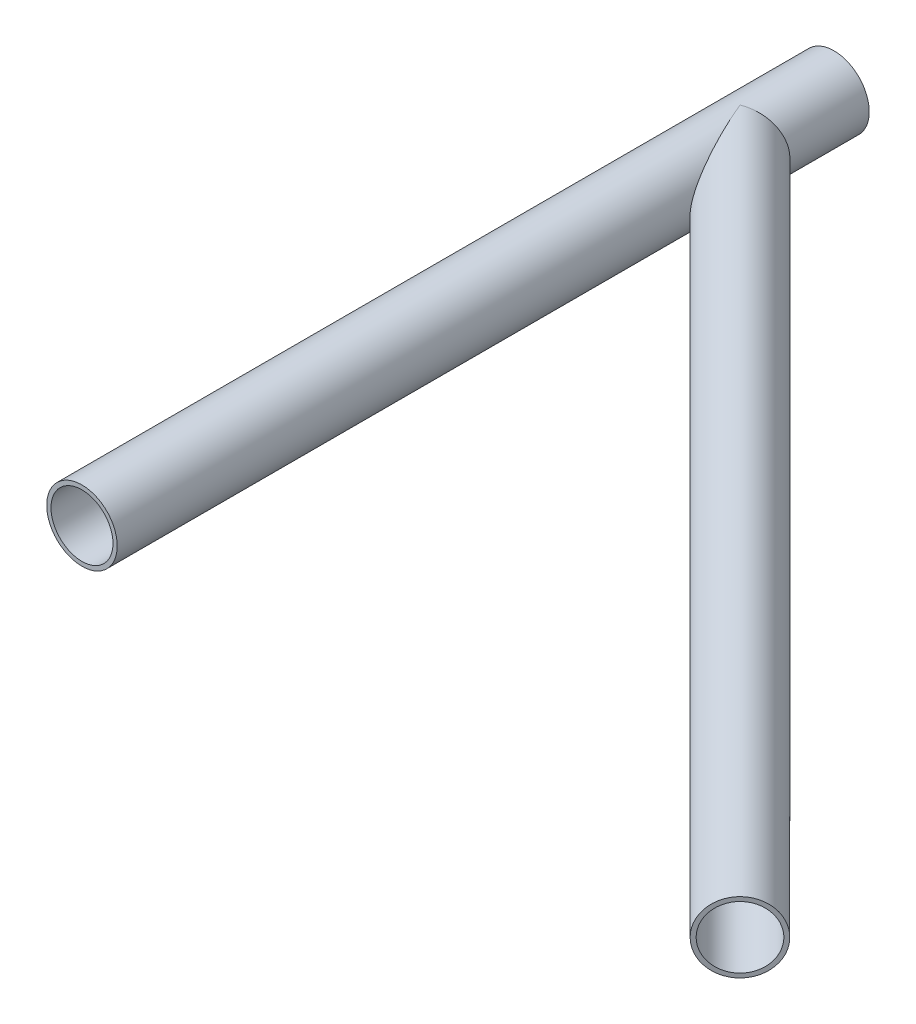
ISO-10303-21;
HEADER;
FILE_DESCRIPTION(('STEP AP214'),'2;1');
FILE_NAME('part.step','',(''),(''),'','','');
FILE_SCHEMA(('AUTOMOTIVE_DESIGN { 1 0 10303 214 1 1 1 1 }'));
ENDSEC;
DATA;
#1=APPLICATION_CONTEXT('core data for automotive mechanical design processes');
#2=APPLICATION_PROTOCOL_DEFINITION('international standard','automotive_design',2000,#1);
#3=PRODUCT_CONTEXT('',#1,'mechanical');
#4=PRODUCT('Part','Part','',(#3));
#5=PRODUCT_RELATED_PRODUCT_CATEGORY('part','',(#4));
#6=PRODUCT_DEFINITION_FORMATION('','',#4);
#7=PRODUCT_DEFINITION_CONTEXT('part definition',#1,'design');
#8=PRODUCT_DEFINITION('design','',#6,#7);
#9=PRODUCT_DEFINITION_SHAPE('','',#8);
#10=(LENGTH_UNIT() NAMED_UNIT(*) SI_UNIT(.MILLI.,.METRE.));
#11=(NAMED_UNIT(*) PLANE_ANGLE_UNIT() SI_UNIT($,.RADIAN.));
#12=(NAMED_UNIT(*) SI_UNIT($,.STERADIAN.) SOLID_ANGLE_UNIT());
#13=UNCERTAINTY_MEASURE_WITH_UNIT(LENGTH_MEASURE(1.E-05),#10,'distance_accuracy_value','');
#14=(GEOMETRIC_REPRESENTATION_CONTEXT(3) GLOBAL_UNCERTAINTY_ASSIGNED_CONTEXT((#13)) GLOBAL_UNIT_ASSIGNED_CONTEXT((#10,
#11,#12)) REPRESENTATION_CONTEXT('',''));
#15=CARTESIAN_POINT('',(0.,0.,0.));
#16=DIRECTION('',(0.,0.,1.));
#17=DIRECTION('',(1.,0.,0.));
#18=AXIS2_PLACEMENT_3D('',#15,#16,#17);
#19=CARTESIAN_POINT('',(0.,0.,203.2));
#20=DIRECTION('',(0.,0.,1.));
#21=DIRECTION('',(1.,0.,0.));
#22=AXIS2_PLACEMENT_3D('',#19,#20,#21);
#23=PLANE('',#22);
#24=CARTESIAN_POINT('',(0.,0.,203.2));
#25=DIRECTION('',(0.,0.,1.));
#26=DIRECTION('',(1.,0.,0.));
#27=AXIS2_PLACEMENT_3D('',#24,#25,#26);
#28=CIRCLE('',#27,9.525);
#29=CARTESIAN_POINT('',(9.525,0.,203.2));
#30=VERTEX_POINT('',#29);
#31=EDGE_CURVE('E177',#30,#30,#28,.T.);
#32=ORIENTED_EDGE('',*,*,#31,.T.);
#33=EDGE_LOOP('',(#32));
#34=FACE_BOUND('',#33,.T.);
#35=CARTESIAN_POINT('',(0.,0.,203.2));
#36=DIRECTION('',(0.,0.,1.));
#37=DIRECTION('',(1.,0.,0.));
#38=AXIS2_PLACEMENT_3D('',#35,#36,#37);
#39=CIRCLE('',#38,8.382);
#40=CARTESIAN_POINT('',(8.382,0.,203.2));
#41=VERTEX_POINT('',#40);
#42=EDGE_CURVE('E170',#41,#41,#39,.T.);
#43=ORIENTED_EDGE('',*,*,#42,.F.);
#44=EDGE_LOOP('',(#43));
#45=FACE_BOUND('',#44,.T.);
#46=ADVANCED_FACE('F48',(#34,#45),#23,.T.);
#47=CARTESIAN_POINT('',(0.,0.,0.));
#48=DIRECTION('',(0.,0.,1.));
#49=DIRECTION('',(1.,0.,0.));
#50=AXIS2_PLACEMENT_3D('',#47,#48,#49);
#51=PLANE('',#50);
#52=CARTESIAN_POINT('',(0.,0.,0.));
#53=DIRECTION('',(0.,0.,1.));
#54=DIRECTION('',(1.,0.,0.));
#55=AXIS2_PLACEMENT_3D('',#52,#53,#54);
#56=CIRCLE('',#55,9.525);
#57=CARTESIAN_POINT('',(9.525,0.,0.));
#58=VERTEX_POINT('',#57);
#59=EDGE_CURVE('E165',#58,#58,#56,.T.);
#60=ORIENTED_EDGE('',*,*,#59,.F.);
#61=EDGE_LOOP('',(#60));
#62=FACE_BOUND('',#61,.T.);
#63=CARTESIAN_POINT('',(0.,0.,0.));
#64=DIRECTION('',(0.,0.,1.));
#65=DIRECTION('',(1.,0.,0.));
#66=AXIS2_PLACEMENT_3D('',#63,#64,#65);
#67=CIRCLE('',#66,8.382);
#68=CARTESIAN_POINT('',(8.382,0.,0.));
#69=VERTEX_POINT('',#68);
#70=EDGE_CURVE('E168',#69,#69,#67,.T.);
#71=ORIENTED_EDGE('',*,*,#70,.T.);
#72=EDGE_LOOP('',(#71));
#73=FACE_BOUND('',#72,.T.);
#74=ADVANCED_FACE('F153',(#62,#73),#51,.F.);
#75=CARTESIAN_POINT('',(0.,0.,203.2));
#76=DIRECTION('',(0.,0.,-1.));
#77=DIRECTION('',(-1.,0.,0.));
#78=AXIS2_PLACEMENT_3D('',#75,#76,#77);
#79=CYLINDRICAL_SURFACE('',#78,9.525);
#80=CARTESIAN_POINT('',(0.,0.,25.4));
#81=DIRECTION('',(0.923879532511287,0.,-0.38268343236509));
#82=DIRECTION('',(-0.38268343236509,0.,-0.923879532511287));
#83=AXIS2_PLACEMENT_3D('',#80,#81,#82);
#84=ELLIPSE('',#83,24.890024480895,9.525);
#85=CARTESIAN_POINT('',(0.,-9.525,25.3999999999999));
#86=VERTEX_POINT('',#85);
#87=CARTESIAN_POINT('',(0.,9.525,25.4));
#88=VERTEX_POINT('',#87);
#89=EDGE_CURVE('E114',#86,#88,#84,.F.);
#90=ORIENTED_EDGE('',*,*,#89,.T.);
#91=CARTESIAN_POINT('',(0.,0.,25.4));
#92=DIRECTION('',(-0.38268343236509,0.,-0.923879532511287));
#93=DIRECTION('',(0.923879532511287,0.,-0.38268343236509));
#94=AXIS2_PLACEMENT_3D('',#91,#92,#93);
#95=ELLIPSE('',#94,10.3097857077851,9.525);
#96=EDGE_CURVE('E171',#88,#86,#95,.T.);
#97=ORIENTED_EDGE('',*,*,#96,.T.);
#98=EDGE_LOOP('',(#90,#97));
#99=FACE_BOUND('',#98,.T.);
#100=ORIENTED_EDGE('',*,*,#31,.F.);
#101=EDGE_LOOP('',(#100));
#102=FACE_BOUND('',#101,.T.);
#103=ORIENTED_EDGE('',*,*,#59,.T.);
#104=EDGE_LOOP('',(#103));
#105=FACE_BOUND('',#104,.T.);
#106=ADVANCED_FACE('F50',(#99,#102,#105),#79,.T.);
#107=CARTESIAN_POINT('',(0.,0.,203.2));
#108=DIRECTION('',(0.,0.,-1.));
#109=DIRECTION('',(-1.,0.,0.));
#110=AXIS2_PLACEMENT_3D('',#107,#108,#109);
#111=CYLINDRICAL_SURFACE('',#110,8.382);
#112=CARTESIAN_POINT('',(0.,0.,25.3999999999999));
#113=DIRECTION('',(-0.707106781186547,0.,-0.707106781186548));
#114=DIRECTION('',(0.707106781186548,0.,-0.707106781186547));
#115=AXIS2_PLACEMENT_3D('',#112,#113,#114);
#116=ELLIPSE('',#115,11.8539380798113,8.382);
#117=CARTESIAN_POINT('',(4.52412433516134,-7.05621874660933,20.8758756648385));
#118=VERTEX_POINT('',#117);
#119=CARTESIAN_POINT('',(0.,-8.382,25.4));
#120=VERTEX_POINT('',#119);
#121=EDGE_CURVE('E64',#118,#120,#116,.T.);
#122=ORIENTED_EDGE('',*,*,#121,.F.);
#123=CARTESIAN_POINT('',(4.52412433516129,7.05621874660936,20.8758756648385));
#124=CARTESIAN_POINT('',(4.62174690177862,6.99362881718293,20.8758673416063));
#125=CARTESIAN_POINT('',(4.71804626749071,6.92902582801489,20.8742967163056));
#126=CARTESIAN_POINT('',(4.90781368240917,6.79593377943272,20.8685236637419));
#127=CARTESIAN_POINT('',(5.00128228957891,6.72744549358692,20.8643217587099));
#128=CARTESIAN_POINT('',(5.27704085145179,6.5164628477521,20.8485173389705));
#129=CARTESIAN_POINT('',(5.45487649013221,6.36832690177239,20.8337141594394));
#130=CARTESIAN_POINT('',(5.79716785090296,6.05838602455667,20.7987657494469));
#131=CARTESIAN_POINT('',(5.96163929909287,5.89659762961534,20.7786269201619));
#132=CARTESIAN_POINT('',(6.27655652399811,5.56020205429996,20.7354317057933));
#133=CARTESIAN_POINT('',(6.42699950838211,5.38559233418328,20.712374742006));
#134=CARTESIAN_POINT('',(6.712618088321,5.02508226793645,20.6653123290561));
#135=CARTESIAN_POINT('',(6.84782756036084,4.8392084469075,20.641309151385));
#136=CARTESIAN_POINT('',(7.10254989276725,4.45695554239161,20.5938036813221));
#137=CARTESIAN_POINT('',(7.22206382909776,4.26057718031457,20.5703013546885));
#138=CARTESIAN_POINT('',(7.44463432618506,3.85851520872857,20.5249857303182));
#139=CARTESIAN_POINT('',(7.54769086481554,3.65283158670956,20.5031724348524));
#140=CARTESIAN_POINT('',(7.73663621475474,3.23346217153021,20.4621794158011));
#141=CARTESIAN_POINT('',(7.82252455932843,3.01977616100418,20.4429997638185));
#142=CARTESIAN_POINT('',(7.97855041747182,2.58002409887501,20.407550037183));
#143=CARTESIAN_POINT('',(8.04820737636085,2.35377989379141,20.3913710849753));
#144=CARTESIAN_POINT('',(8.16818566693626,1.89596041184051,20.3631786363174));
#145=CARTESIAN_POINT('',(8.21850663364273,1.66438503443118,20.3511652184948));
#146=CARTESIAN_POINT('',(8.29938572434853,1.19759470870866,20.331728661746));
#147=CARTESIAN_POINT('',(8.32994211702873,0.962379443399279,20.3243059249526));
#148=CARTESIAN_POINT('',(8.37101537379436,0.490106318965916,20.3143067274065));
#149=CARTESIAN_POINT('',(8.38153276545369,0.253048508516272,20.3117301390677));
#150=CARTESIAN_POINT('',(8.38242437939365,-0.21459024197382,20.3115119782873));
#151=CARTESIAN_POINT('',(8.3733438343853,-0.445170272375054,20.3137368253656));
#152=CARTESIAN_POINT('',(8.3362203553048,-0.904704014620379,20.3227799223467));
#153=CARTESIAN_POINT('',(8.3081777883896,-1.13365775786713,20.3295980833103));
#154=CARTESIAN_POINT('',(8.23337193942703,-1.58825858987111,20.3476057346166));
#155=CARTESIAN_POINT('',(8.18661263859585,-1.81390637126174,20.3587942953241));
#156=CARTESIAN_POINT('',(8.07475189842487,-2.26036895008737,20.3851698911357));
#157=CARTESIAN_POINT('',(8.00965027680887,-2.48118369947078,20.4003569659748));
#158=CARTESIAN_POINT('',(7.86174545406413,-2.91608354577751,20.4341656395663));
#159=CARTESIAN_POINT('',(7.77897418795115,-3.13017999470861,20.4527810339626));
#160=CARTESIAN_POINT('',(7.59627377023972,-3.55064676731417,20.492760077895));
#161=CARTESIAN_POINT('',(7.4963449440189,-3.75701723741447,20.514123675312));
#162=CARTESIAN_POINT('',(7.27999816358584,-4.16077161869243,20.5587045973996));
#163=CARTESIAN_POINT('',(7.1635765957098,-4.35815354786604,20.5819223278346));
#164=CARTESIAN_POINT('',(6.91500393099862,-4.74268522411487,20.6290755742576));
#165=CARTESIAN_POINT('',(6.78285132920174,-4.92983398969697,20.6530111587574));
#166=CARTESIAN_POINT('',(6.49683527945747,-5.30157570306154,20.7013211123207));
#167=CARTESIAN_POINT('',(6.34222842805628,-5.48560147371333,20.7256601871055));
#168=CARTESIAN_POINT('',(6.01758185379939,-5.83989126656191,20.7714764715826));
#169=CARTESIAN_POINT('',(5.84754464188152,-6.01015751931049,20.7929541455035));
#170=CARTESIAN_POINT('',(5.58164861352218,-6.25441063236971,20.8209932142902));
#171=CARTESIAN_POINT('',(5.49112773166827,-6.33403401885244,20.8296489474119));
#172=CARTESIAN_POINT('',(5.30664160362406,-6.48937712570548,20.8451373472314));
#173=CARTESIAN_POINT('',(5.2126765568425,-6.56509707146655,20.851970119285));
#174=CARTESIAN_POINT('',(5.02139945805454,-6.71253013092088,20.8633525266468));
#175=CARTESIAN_POINT('',(4.92408485789378,-6.78424008010096,20.8679003807793));
#176=CARTESIAN_POINT('',(4.726365505643,-6.92344038697056,20.8741563458945));
#177=CARTESIAN_POINT('',(4.62596008353463,-6.99092982000034,20.875863836674));
#178=CARTESIAN_POINT('',(4.52412433516129,-7.05621874660936,20.8758756648385));
#179=B_SPLINE_CURVE_WITH_KNOTS('',3,(#123,#124,#125,#126,#127,#128,#129,#130,#131,#132,#133,
#134,#135,#136,#137,#138,#139,#140,#141,#142,#143,#144,#145,#146,#147,#148,#149,#150,#151,#152,
#153,#154,#155,#156,#157,#158,#159,#160,#161,#162,#163,#164,#165,#166,#167,#168,#169,#170,#171,
#172,#173,#174,#175,#176,#177,#178),.UNSPECIFIED.,.F.,.F.,(4,2,2,2,2,2,2,2,2,2,2,2,2,2,2,2,2,2,
2,2,2,2,2,2,2,2,2,4),(0.,0.347809451338773,0.6955498946972,1.39034566835515,2.08431164090388,
2.77841545213018,3.4709438985176,4.16342484572802,4.85590672394276,5.54840742542986,
6.25935629374673,6.97031858104451,7.68134313813697,8.39234897557398,9.08382943217402,
9.77529650019177,10.4666165650918,11.1579435002041,11.8480313952483,12.5381062048444,
13.2283324487166,13.9186247785307,14.6424961296462,15.3662498977822,15.7287481334042,
16.0912254143144,16.453984822573,16.8168234302219),.UNSPECIFIED.);
#180=CARTESIAN_POINT('',(4.52412433516134,7.05621874660933,20.8758756648385));
#181=VERTEX_POINT('',#180);
#182=EDGE_CURVE('E108',#181,#118,#179,.T.);
#183=ORIENTED_EDGE('',*,*,#182,.F.);
#184=CARTESIAN_POINT('',(0.,8.382,25.4));
#185=VERTEX_POINT('',#184);
#186=EDGE_CURVE('E72',#185,#181,#116,.T.);
#187=ORIENTED_EDGE('',*,*,#186,.F.);
#188=CARTESIAN_POINT('',(-4.52412433516157,7.05621874660919,29.9241243351614));
#189=VERTEX_POINT('',#188);
#190=EDGE_CURVE('E95',#189,#185,#116,.T.);
#191=ORIENTED_EDGE('',*,*,#190,.F.);
#192=CARTESIAN_POINT('',(-4.52412433516162,-7.05621874660915,29.9241243351614));
#193=CARTESIAN_POINT('',(-4.39508285374541,-7.13897879103404,29.9241464590843));
#194=CARTESIAN_POINT('',(-4.26369315473491,-7.21820007025961,29.9268856335933));
#195=CARTESIAN_POINT('',(-3.99683825888938,-7.36930542427667,29.9392781413515));
#196=CARTESIAN_POINT('',(-3.86136746543464,-7.44117876849912,29.9489414259677));
#197=CARTESIAN_POINT('',(-3.58673763219339,-7.5773906386555,29.9767323770896));
#198=CARTESIAN_POINT('',(-3.44756485628776,-7.64169419134202,29.9948975392707));
#199=CARTESIAN_POINT('',(-3.16736274888595,-7.76202058117549,30.041236095364));
#200=CARTESIAN_POINT('',(-3.02633427794577,-7.8180471188566,30.0694049974569));
#201=CARTESIAN_POINT('',(-2.74235497973716,-7.92215372700152,30.1374504475968));
#202=CARTESIAN_POINT('',(-2.59939958490397,-7.97014358386504,30.1774475494694));
#203=CARTESIAN_POINT('',(-2.31485273593127,-8.05738960538484,30.2699401414254));
#204=CARTESIAN_POINT('',(-2.17326128360834,-8.0966457584106,30.3224356481525));
#205=CARTESIAN_POINT('',(-1.89397996962005,-8.16647955664907,30.4398102571157));
#206=CARTESIAN_POINT('',(-1.75627415876454,-8.19709954976338,30.5046262274907));
#207=CARTESIAN_POINT('',(-1.48556801117738,-8.25045818269902,30.6462020318448));
#208=CARTESIAN_POINT('',(-1.35256816847324,-8.2731959972489,30.72296311527));
#209=CARTESIAN_POINT('',(-1.07546798561698,-8.31404698055081,30.8978421555512));
#210=CARTESIAN_POINT('',(-0.932159394089894,-8.33118046923258,30.9974384503052));
#211=CARTESIAN_POINT('',(-0.653485834476461,-8.35766086928232,31.2080729109438));
#212=CARTESIAN_POINT('',(-0.518123091535345,-8.36700560907786,31.3191142581208));
#213=CARTESIAN_POINT('',(-0.254457072672913,-8.37918251068077,31.5510220636951));
#214=CARTESIAN_POINT('',(-0.126199292590957,-8.38197658722883,31.671941769663));
#215=CARTESIAN_POINT('',(0.122997391650685,-8.38202310703236,31.9210131159163));
#216=CARTESIAN_POINT('',(0.243936887252979,-8.37927599872812,32.0491641701629));
#217=CARTESIAN_POINT('',(0.521693938386189,-8.36728560873389,32.3582104671464));
#218=CARTESIAN_POINT('',(0.675761107716972,-8.35606037178492,32.541490853426));
#219=CARTESIAN_POINT('',(0.974030888454506,-8.32656179457727,32.9154236250548));
#220=CARTESIAN_POINT('',(1.11822799187765,-8.30828455610628,33.1060800351914));
#221=CARTESIAN_POINT('',(1.39878257282121,-8.26568159127951,33.4929594518717));
#222=CARTESIAN_POINT('',(1.53512398599541,-8.24134397721603,33.6891927194247));
#223=CARTESIAN_POINT('',(1.80112225298878,-8.18732477728917,34.0853336874009));
#224=CARTESIAN_POINT('',(1.9307803885708,-8.15764422107247,34.285240673203));
#225=CARTESIAN_POINT('',(2.18521131383608,-8.093211406221,34.688645001926));
#226=CARTESIAN_POINT('',(2.30995852710006,-8.05843616183735,34.892154733423));
#227=CARTESIAN_POINT('',(2.55486019058051,-7.98417069758534,35.3010682434128));
#228=CARTESIAN_POINT('',(2.67501448492692,-7.94468031788645,35.506472085893));
#229=CARTESIAN_POINT('',(2.91131157798092,-7.86116218247935,35.9183274947497));
#230=CARTESIAN_POINT('',(3.02745888178566,-7.81713975993731,36.1247775638827));
#231=CARTESIAN_POINT('',(3.25644772326557,-7.72455299795054,36.5384927138965));
#232=CARTESIAN_POINT('',(3.36928918533785,-7.67598855473847,36.7457578132939));
#233=CARTESIAN_POINT('',(3.62478836080837,-7.55936090254035,37.2215844982931));
#234=CARTESIAN_POINT('',(3.76648042925547,-7.48975734058827,37.4902884575547));
#235=CARTESIAN_POINT('',(4.04575639751933,-7.34266160453611,38.0276780632027));
#236=CARTESIAN_POINT('',(4.18334019643372,-7.26516923688645,38.296363708978));
#237=CARTESIAN_POINT('',(4.45497920827497,-7.10184624576113,38.833273687188));
#238=CARTESIAN_POINT('',(4.58903155133152,-7.01600909127553,39.1014974883447));
#239=CARTESIAN_POINT('',(4.85380166249062,-6.83551056889007,39.636627186034));
#240=CARTESIAN_POINT('',(4.98451941300114,-6.74084915444901,39.9035330756079));
#241=CARTESIAN_POINT('',(5.2425134177331,-6.5422037920803,40.4347920203802));
#242=CARTESIAN_POINT('',(5.36979617187621,-6.43823933376421,40.6991491843027));
#243=CARTESIAN_POINT('',(5.62121128023137,-6.21993791211738,41.2250670937385));
#244=CARTESIAN_POINT('',(5.7453437484358,-6.1056013247866,41.4866279402371));
#245=CARTESIAN_POINT('',(5.99018969249668,-5.865570333833,42.0056967212173));
#246=CARTESIAN_POINT('',(6.11090701164932,-5.73988942368791,42.2632090538509));
#247=CARTESIAN_POINT('',(6.34879182643834,-5.47561773697481,42.7733076940372));
#248=CARTESIAN_POINT('',(6.46595866999685,-5.33702460777459,43.0258930937141));
#249=CARTESIAN_POINT('',(6.69714024041403,-5.04394479610323,43.5264942810609));
#250=CARTESIAN_POINT('',(6.81112073426577,-4.88933574798221,43.7744547423811));
#251=CARTESIAN_POINT('',(7.03396234397611,-4.56293226255249,44.2611020138257));
#252=CARTESIAN_POINT('',(7.14282600680563,-4.39114651125192,44.4997934272342));
#253=CARTESIAN_POINT('',(7.35352251295296,-4.02832951028085,44.9632646038738));
#254=CARTESIAN_POINT('',(7.4553890557372,-3.8374032779089,45.1881104140506));
#255=CARTESIAN_POINT('',(7.65036453177072,-3.43225314517183,45.6196348778579));
#256=CARTESIAN_POINT('',(7.74348687312123,-3.21806603719673,45.826341312926));
#257=CARTESIAN_POINT('',(7.89819562291066,-2.81289135206249,46.1704950023705));
#258=CARTESIAN_POINT('',(7.96219560921508,-2.62729448877403,46.3131351628971));
#259=CARTESIAN_POINT('',(8.08028882337544,-2.23792794255638,46.5766950373538));
#260=CARTESIAN_POINT('',(8.13437633728916,-2.03414787810398,46.6976022227693));
#261=CARTESIAN_POINT('',(8.22975131926356,-1.6054979945276,46.9110136220419));
#262=CARTESIAN_POINT('',(8.27087252745749,-1.38039887779241,47.0031487741535));
#263=CARTESIAN_POINT('',(8.31907263384374,-1.03187402895768,47.1112055789753));
#264=CARTESIAN_POINT('',(8.33288897744129,-0.913945683440551,47.1421925292835));
#265=CARTESIAN_POINT('',(8.35561558285361,-0.675240131364648,47.1931736151595));
#266=CARTESIAN_POINT('',(8.36452668859961,-0.554463418589934,47.2131696416815));
#267=CARTESIAN_POINT('',(8.37655323106707,-0.321921556453732,47.2401588196002));
#268=CARTESIAN_POINT('',(8.38010759943823,-0.210292695799836,47.248136709346));
#269=CARTESIAN_POINT('',(8.38273470798142,0.0132805712896537,47.2540332149029));
#270=CARTESIAN_POINT('',(8.38180778827737,0.12522495313308,47.2519525941418));
#271=CARTESIAN_POINT('',(8.37550046389653,0.348395324126996,47.2377964631409));
#272=CARTESIAN_POINT('',(8.37011831604602,0.459621014909252,47.2257170407225));
#273=CARTESIAN_POINT('',(8.35508178950846,0.680281362009268,47.1919772805364));
#274=CARTESIAN_POINT('',(8.34542745727056,0.789716037786351,47.1703170469356));
#275=CARTESIAN_POINT('',(8.31347518263654,1.08620586831899,47.0986517284833));
#276=CARTESIAN_POINT('',(8.28710949910923,1.27068098731305,47.0395367007893));
#277=CARTESIAN_POINT('',(8.22426420503789,1.62866970957397,46.8987506659354));
#278=CARTESIAN_POINT('',(8.18778291115062,1.80218148251956,46.8170759046089));
#279=CARTESIAN_POINT('',(8.07643425364322,2.26273941922265,46.5680590681848));
#280=CARTESIAN_POINT('',(7.99324102424299,2.53785027397907,46.3822798993956));
#281=CARTESIAN_POINT('',(7.85634926310757,2.9248126782968,46.0773789868305));
#282=CARTESIAN_POINT('',(7.80859153753371,3.04974517780816,45.9711289722749));
#283=CARTESIAN_POINT('',(7.70970431764343,3.29172072306574,45.7514307080414));
#284=CARTESIAN_POINT('',(7.65857555808345,3.40876547686608,45.6379840271641));
#285=CARTESIAN_POINT('',(7.50607517724958,3.73812050040514,45.3001265838821));
#286=CARTESIAN_POINT('',(7.40106120762084,3.94091661026684,45.0681012548443));
#287=CARTESIAN_POINT('',(7.18372559417699,4.3244139845689,44.5895844277467));
#288=CARTESIAN_POINT('',(7.07139698971945,4.50509371797252,44.3430791730208));
#289=CARTESIAN_POINT('',(6.84082033985135,4.84808249124471,43.8391443338332));
#290=CARTESIAN_POINT('',(6.72255596911634,5.0103363543575,43.5816849551667));
#291=CARTESIAN_POINT('',(6.48150754649885,5.31847784263079,43.0594321373915));
#292=CARTESIAN_POINT('',(6.35872517292059,5.4643714652283,42.7946414305247));
#293=CARTESIAN_POINT('',(6.09318543623146,5.75980762841856,42.2251717694585));
#294=CARTESIAN_POINT('',(5.94988931928378,5.90740821422166,41.9197409713192));
#295=CARTESIAN_POINT('',(5.65873915100412,6.18686485395233,41.3038368851307));
#296=CARTESIAN_POINT('',(5.51088400327016,6.3187170828087,40.9933623927518));
#297=CARTESIAN_POINT('',(5.21060096828081,6.56854236398606,40.3685380968177));
#298=CARTESIAN_POINT('',(5.0581675387143,6.68649766712046,40.0541838919464));
#299=CARTESIAN_POINT('',(4.7487881232795,6.90965313539947,39.4232345817443));
#300=CARTESIAN_POINT('',(4.59184256123441,7.01485449370689,39.1066396889728));
#301=CARTESIAN_POINT('',(4.27333864348285,7.21329571476529,38.4729068006839));
#302=CARTESIAN_POINT('',(4.11179036533271,7.30655957257854,38.1557712356385));
#303=CARTESIAN_POINT('',(3.78303689262652,7.48206438533828,37.5213468826697));
#304=CARTESIAN_POINT('',(3.61583123569807,7.56430443658046,37.2040580843218));
#305=CARTESIAN_POINT('',(3.2748273005101,7.71805536047456,36.5708771884053));
#306=CARTESIAN_POINT('',(3.10103623555201,7.78957757023651,36.2549839629669));
#307=CARTESIAN_POINT('',(2.74504862068494,7.92204194635169,35.6257661128338));
#308=CARTESIAN_POINT('',(2.56285368054577,7.98298612837045,35.3124410096436));
#309=CARTESIAN_POINT('',(2.2598328277108,8.07251541575873,34.8102412508766));
#310=CARTESIAN_POINT('',(2.14240455339859,8.1045218297034,34.619923716523));
#311=CARTESIAN_POINT('',(1.90260538266532,8.16414715854187,34.2417127329709));
#312=CARTESIAN_POINT('',(1.78023445475218,8.19176604547503,34.0538192992277));
#313=CARTESIAN_POINT('',(1.52921628796063,8.24232145373866,33.6808483659458));
#314=CARTESIAN_POINT('',(1.40055274101203,8.26524491243079,33.4957800130708));
#315=CARTESIAN_POINT('',(1.13600273787376,8.30574124760114,33.1302387891758));
#316=CARTESIAN_POINT('',(1.00011622905212,8.32331408508441,32.9497659516563));
#317=CARTESIAN_POINT('',(0.717382477697239,8.35247374215889,32.5923710062582));
#318=CARTESIAN_POINT('',(0.570396131540374,8.36396174608271,32.4155498406097));
#319=CARTESIAN_POINT('',(0.26551098537415,8.37918477115149,32.071002763194));
#320=CARTESIAN_POINT('',(0.107608855244617,8.3829174154577,31.9032796551049));
#321=CARTESIAN_POINT('',(-0.219889364134607,8.38070659196313,31.5815809119328));
#322=CARTESIAN_POINT('',(-0.389410604198486,8.37482033774026,31.4275296944307));
#323=CARTESIAN_POINT('',(-0.741990087979277,8.350957034228,31.1368728947722));
#324=CARTESIAN_POINT('',(-0.925031899318688,8.3329944536326,31.0002466684402));
#325=CARTESIAN_POINT('',(-1.23037024105701,8.29203069830089,30.7981738799937));
#326=CARTESIAN_POINT('',(-1.34865926022438,8.27369351864312,30.7256867997484));
#327=CARTESIAN_POINT('',(-1.58940317334477,8.23083571297068,30.5900989062924));
#328=CARTESIAN_POINT('',(-1.71185657390472,8.20631728380738,30.5269947709704));
#329=CARTESIAN_POINT('',(-1.95998956363228,8.15061525076923,30.4108120962749));
#330=CARTESIAN_POINT('',(-2.0856696254878,8.11943066538058,30.3577350354415));
#331=CARTESIAN_POINT('',(-2.33899360076787,8.05011018580737,30.2617899349801));
#332=CARTESIAN_POINT('',(-2.46663756651398,8.01197410612923,30.2189221678472));
#333=CARTESIAN_POINT('',(-2.72206162932807,7.92882565124666,30.1432025613617));
#334=CARTESIAN_POINT('',(-2.84983939463432,7.88383977009227,30.1103135328241));
#335=CARTESIAN_POINT('',(-3.10478079766107,7.78696730441621,30.0535717917034));
#336=CARTESIAN_POINT('',(-3.23194435883574,7.73507988166362,30.0297201781215));
#337=CARTESIAN_POINT('',(-3.48468945645833,7.62455963937875,29.9900178514296));
#338=CARTESIAN_POINT('',(-3.61026948824901,7.56592087252337,29.9741742599038));
#339=CARTESIAN_POINT('',(-3.85885955566695,7.44220383799493,29.9493874168556));
#340=CARTESIAN_POINT('',(-3.98187026607173,7.37712728749212,29.9404423308422));
#341=CARTESIAN_POINT('',(-4.17469038860019,7.26887872496791,29.9308184368107));
#342=CARTESIAN_POINT('',(-4.24555243723717,7.22771915428535,29.9282525588124));
#343=CARTESIAN_POINT('',(-4.38586362434184,7.14344477984492,29.9249092471269));
#344=CARTESIAN_POINT('',(-4.45531631297013,7.1003360994599,29.9241265620818));
#345=CARTESIAN_POINT('',(-4.52412433516162,7.05621874660915,29.9241243351614));
#346=B_SPLINE_CURVE_WITH_KNOTS('',3,(#192,#193,#194,#195,#196,#197,#198,#199,#200,#201,#202,
#203,#204,#205,#206,#207,#208,#209,#210,#211,#212,#213,#214,#215,#216,#217,#218,#219,#220,#221,
#222,#223,#224,#225,#226,#227,#228,#229,#230,#231,#232,#233,#234,#235,#236,#237,#238,#239,#240,
#241,#242,#243,#244,#245,#246,#247,#248,#249,#250,#251,#252,#253,#254,#255,#256,#257,#258,#259,
#260,#261,#262,#263,#264,#265,#266,#267,#268,#269,#270,#271,#272,#273,#274,#275,#276,#277,#278,
#279,#280,#281,#282,#283,#284,#285,#286,#287,#288,#289,#290,#291,#292,#293,#294,#295,#296,#297,
#298,#299,#300,#301,#302,#303,#304,#305,#306,#307,#308,#309,#310,#311,#312,#313,#314,#315,#316,
#317,#318,#319,#320,#321,#322,#323,#324,#325,#326,#327,#328,#329,#330,#331,#332,#333,#334,#335,
#336,#337,#338,#339,#340,#341,#342,#343,#344,#345),.UNSPECIFIED.,.F.,.F.,(4,2,2,2,2,2,2,2,2,2,2,
2,2,2,2,2,2,2,2,2,2,2,2,2,2,2,2,2,2,2,2,2,2,2,2,2,2,2,2,2,2,2,2,2,2,2,2,2,2,2,2,2,2,2,2,2,2,2,2,
2,2,2,2,2,2,2,2,2,2,2,2,2,2,2,2,2,4),(0.,0.459919275564052,0.920500878740572,1.3831331988249,
1.84555805261614,2.31286870534058,2.78017998037028,3.24515826515114,3.71018521889873,
4.23540970101076,4.76078057143899,5.28919843024313,5.81757352664993,6.53608859623019,
7.25500141763249,7.97533568417485,8.6955312823012,9.41908241317131,10.1426580774639,
10.8653917880437,11.5881420142852,12.5229459321535,13.4577727906964,14.3933372693546,
15.3289066826764,16.262560047504,17.1961795799855,18.1287028974649,19.0613964560911,
20.0018311543184,20.9417926707264,21.8768531769559,22.8104556388329,23.5369930879496,
24.2639480337482,24.9998772597626,25.3674886058959,25.7350366858337,26.070421162393,
26.4057801841082,26.7412704820417,27.0767571324604,27.6608723533139,28.2450848354374,
29.2654005766358,29.777658125686,30.2898043889545,31.2648575343613,32.2408525019996,
33.2196970625863,34.1981816111397,35.302453704258,36.4069934676253,37.512928999921,
38.6187609892664,39.7223340686666,40.8259975609936,41.9284852529052,43.0307626322688,
43.7083998264708,44.3860413389147,45.0655431785791,45.7450499702879,46.4352773554646,
47.1257162482219,47.8120633120352,48.4975895227164,48.9169559827592,49.3361736071673,
49.7554529990517,50.1747435806197,50.5924517750049,51.0102107487966,51.4283405874634,
51.8463591962276,52.0922760218892,52.3374677012459),.UNSPECIFIED.);
#347=CARTESIAN_POINT('',(-4.52412433516156,-7.05621874660919,29.9241243351614));
#348=VERTEX_POINT('',#347);
#349=EDGE_CURVE('E53',#348,#189,#346,.T.);
#350=ORIENTED_EDGE('',*,*,#349,.F.);
#351=EDGE_CURVE('E79',#120,#348,#116,.T.);
#352=ORIENTED_EDGE('',*,*,#351,.F.);
#353=EDGE_LOOP('',(#122,#183,#187,#191,#350,#352));
#354=FACE_BOUND('',#353,.T.);
#355=ORIENTED_EDGE('',*,*,#42,.T.);
#356=EDGE_LOOP('',(#355));
#357=FACE_BOUND('',#356,.T.);
#358=ORIENTED_EDGE('',*,*,#70,.F.);
#359=EDGE_LOOP('',(#358));
#360=FACE_BOUND('',#359,.T.);
#361=ADVANCED_FACE('F97',(#354,#357,#360),#111,.F.);
#362=CARTESIAN_POINT('',(185.239487757862,0.,210.639487757862));
#363=DIRECTION('',(-0.707106781186548,0.,-0.707106781186548));
#364=DIRECTION('',(-0.707106781186548,0.,0.707106781186548));
#365=AXIS2_PLACEMENT_3D('',#362,#363,#364);
#366=CYLINDRICAL_SURFACE('',#365,9.525);
#367=CARTESIAN_POINT('',(0.,0.,25.3999999999999));
#368=DIRECTION('',(-0.707106781186547,0.,-0.707106781186548));
#369=DIRECTION('',(-0.707106781186548,0.,0.707106781186547));
#370=AXIS2_PLACEMENT_3D('',#367,#368,#369);
#371=CIRCLE('',#370,9.525);
#372=EDGE_CURVE('E107',#348,#189,#371,.T.);
#373=ORIENTED_EDGE('',*,*,#372,.F.);
#374=ORIENTED_EDGE('',*,*,#349,.T.);
#375=EDGE_LOOP('',(#373,#374));
#376=FACE_BOUND('',#375,.T.);
#377=ADVANCED_FACE('F106',(#376),#366,.T.);
#378=CARTESIAN_POINT('',(185.239487757862,0.,210.639487757862));
#379=DIRECTION('',(-0.707106781186548,0.,-0.707106781186548));
#380=DIRECTION('',(-0.707106781186548,0.,0.707106781186548));
#381=AXIS2_PLACEMENT_3D('',#378,#379,#380);
#382=CYLINDRICAL_SURFACE('',#381,8.382);
#383=CARTESIAN_POINT('',(0.,0.,25.4));
#384=DIRECTION('',(0.923879532511287,0.,-0.38268343236509));
#385=DIRECTION('',(-0.38268343236509,0.,-0.923879532511287));
#386=AXIS2_PLACEMENT_3D('',#383,#384,#385);
#387=ELLIPSE('',#386,21.9032215431876,8.382);
#388=EDGE_CURVE('E180',#120,#185,#387,.F.);
#389=ORIENTED_EDGE('',*,*,#388,.F.);
#390=CARTESIAN_POINT('',(0.,0.,25.3999999999999));
#391=DIRECTION('',(-0.707106781186547,0.,-0.707106781186548));
#392=DIRECTION('',(-0.707106781186548,0.,0.707106781186547));
#393=AXIS2_PLACEMENT_3D('',#390,#391,#392);
#394=CIRCLE('',#393,8.382);
#395=EDGE_CURVE('E192',#120,#185,#394,.T.);
#396=ORIENTED_EDGE('',*,*,#395,.T.);
#397=EDGE_LOOP('',(#389,#396));
#398=FACE_BOUND('',#397,.T.);
#399=ADVANCED_FACE('F125',(#398),#382,.F.);
#400=CARTESIAN_POINT('',(0.,0.,25.3999999999999));
#401=DIRECTION('',(-0.707106781186547,0.,-0.707106781186548));
#402=DIRECTION('',(-0.707106781186548,0.,0.707106781186547));
#403=AXIS2_PLACEMENT_3D('',#400,#401,#402);
#404=PLANE('',#403);
#405=ORIENTED_EDGE('',*,*,#395,.F.);
#406=ORIENTED_EDGE('',*,*,#351,.T.);
#407=ORIENTED_EDGE('',*,*,#372,.T.);
#408=ORIENTED_EDGE('',*,*,#190,.T.);
#409=EDGE_LOOP('',(#405,#406,#407,#408));
#410=FACE_BOUND('',#409,.T.);
#411=ADVANCED_FACE('F109',(#410),#404,.T.);
#412=CARTESIAN_POINT('',(0.,0.,25.4));
#413=DIRECTION('',(-0.38268343236509,0.,-0.923879532511287));
#414=DIRECTION('',(0.923879532511287,0.,-0.38268343236509));
#415=AXIS2_PLACEMENT_3D('',#412,#413,#414);
#416=ELLIPSE('',#415,9.07261142285085,8.382);
#417=EDGE_CURVE('E182',#185,#120,#416,.T.);
#418=ORIENTED_EDGE('',*,*,#417,.F.);
#419=EDGE_CURVE('E116',#185,#120,#394,.T.);
#420=ORIENTED_EDGE('',*,*,#419,.T.);
#421=EDGE_LOOP('',(#418,#420));
#422=FACE_BOUND('',#421,.T.);
#423=ADVANCED_FACE('F130',(#422),#382,.F.);
#424=EDGE_CURVE('E110',#181,#118,#371,.T.);
#425=ORIENTED_EDGE('',*,*,#424,.F.);
#426=ORIENTED_EDGE('',*,*,#182,.T.);
#427=EDGE_LOOP('',(#425,#426));
#428=FACE_BOUND('',#427,.T.);
#429=ADVANCED_FACE('F131',(#428),#366,.T.);
#430=ORIENTED_EDGE('',*,*,#424,.T.);
#431=ORIENTED_EDGE('',*,*,#121,.T.);
#432=ORIENTED_EDGE('',*,*,#419,.F.);
#433=ORIENTED_EDGE('',*,*,#186,.T.);
#434=EDGE_LOOP('',(#430,#431,#432,#433));
#435=FACE_BOUND('',#434,.T.);
#436=ADVANCED_FACE('F135',(#435),#404,.T.);
#437=CARTESIAN_POINT('',(185.239487757862,0.,210.639487757862));
#438=DIRECTION('',(-0.707106781186547,0.,-0.707106781186548));
#439=DIRECTION('',(-0.707106781186548,0.,0.707106781186547));
#440=AXIS2_PLACEMENT_3D('',#437,#438,#439);
#441=CIRCLE('',#440,9.525);
#442=CARTESIAN_POINT('',(178.50429566706,0.,217.374679848664));
#443=VERTEX_POINT('',#442);
#444=EDGE_CURVE('E111',#443,#443,#441,.T.);
#445=ORIENTED_EDGE('',*,*,#444,.T.);
#446=EDGE_LOOP('',(#445));
#447=FACE_BOUND('',#446,.T.);
#448=ORIENTED_EDGE('',*,*,#96,.F.);
#449=ORIENTED_EDGE('',*,*,#89,.F.);
#450=EDGE_LOOP('',(#448,#449));
#451=FACE_BOUND('',#450,.T.);
#452=ADVANCED_FACE('F137',(#447,#451),#366,.T.);
#453=CARTESIAN_POINT('',(185.239487757862,0.,210.639487757862));
#454=DIRECTION('',(-0.707106781186547,0.,-0.707106781186548));
#455=DIRECTION('',(-0.707106781186548,0.,0.707106781186547));
#456=AXIS2_PLACEMENT_3D('',#453,#454,#455);
#457=CIRCLE('',#456,8.382);
#458=CARTESIAN_POINT('',(179.312518717956,0.,216.566456797767));
#459=VERTEX_POINT('',#458);
#460=EDGE_CURVE('E194',#459,#459,#457,.T.);
#461=ORIENTED_EDGE('',*,*,#460,.F.);
#462=EDGE_LOOP('',(#461));
#463=FACE_BOUND('',#462,.T.);
#464=CARTESIAN_POINT('',(9.52499999999995,0.,46.7789380798112));
#465=CARTESIAN_POINT('',(9.52499903233287,0.105738476546287,46.778935593312));
#466=CARTESIAN_POINT('',(9.52323245718422,0.211506750456441,46.7743302675665));
#467=CARTESIAN_POINT('',(9.51622559247728,0.422162893991244,46.7560610192663));
#468=CARTESIAN_POINT('',(9.51098325503587,0.527050207647067,46.7423917563331));
#469=CARTESIAN_POINT('',(9.49022139253885,0.839511316655456,46.6882433537905));
#470=CARTESIAN_POINT('',(9.4696676356249,1.04458531626212,46.6346251782408));
#471=CARTESIAN_POINT('',(9.41077910021178,1.49190418038552,46.4808583755523));
#472=CARTESIAN_POINT('',(9.36930714085277,1.7308253370632,46.3724899344542));
#473=CARTESIAN_POINT('',(9.2734574790059,2.18706034629743,46.121603005635));
#474=CARTESIAN_POINT('',(9.21905686421762,2.40433485502465,45.979023885021));
#475=CARTESIAN_POINT('',(9.11120127172505,2.78271321061975,45.6957497897526));
#476=CARTESIAN_POINT('',(9.05914119139514,2.94710335720387,45.5588111828614));
#477=CARTESIAN_POINT('',(8.95033543610657,3.26266730242269,45.2720388983686));
#478=CARTESIAN_POINT('',(8.89358639679031,3.4138314483658,45.1221959585105));
#479=CARTESIAN_POINT('',(8.77652218485075,3.70443819930251,44.8123918059159));
#480=CARTESIAN_POINT('',(8.71620063832582,3.84385870898563,44.6524124704815));
#481=CARTESIAN_POINT('',(8.59293485541766,4.11204026395682,44.3246585962802));
#482=CARTESIAN_POINT('',(8.5299895897486,4.24079706556422,44.1568809952234));
#483=CARTESIAN_POINT('',(8.39884932706655,4.49516108428757,43.8063241081987));
#484=CARTESIAN_POINT('',(8.33055113912708,4.62026165004106,43.6232176385175));
#485=CARTESIAN_POINT('',(8.19238990547015,4.86103147072155,43.2515405473314));
#486=CARTESIAN_POINT('',(8.12252702566078,4.97670171958952,43.0629705045257));
#487=CARTESIAN_POINT('',(7.98160755586202,5.19970970083095,42.6811400124746));
#488=CARTESIAN_POINT('',(7.9105498407198,5.30703897440897,42.4878750560501));
#489=CARTESIAN_POINT('',(7.76766681679801,5.51405258039888,42.0975596958496));
#490=CARTESIAN_POINT('',(7.69584141711761,5.61373599578501,41.9005088415352));
#491=CARTESIAN_POINT('',(7.47935639625255,5.90279918816762,41.3036585079484));
#492=CARTESIAN_POINT('',(7.33400385373837,6.08170291817547,40.8990149096198));
#493=CARTESIAN_POINT('',(7.04364535015069,6.41572495717663,40.0802793086173));
#494=CARTESIAN_POINT('',(6.89863925797588,6.57085444142819,39.6661918509086));
#495=CARTESIAN_POINT('',(6.66673914595415,6.80409790906196,38.9926301345711));
#496=CARTESIAN_POINT('',(6.57916343015807,6.88871139291066,38.7356145989773));
#497=CARTESIAN_POINT('',(6.40528118182877,7.05068235717075,38.2188716136253));
#498=CARTESIAN_POINT('',(6.31897468087238,7.12803965731199,37.9591440966695));
#499=CARTESIAN_POINT('',(6.14811298789674,7.27592594445725,37.4370384224672));
#500=CARTESIAN_POINT('',(6.06355864822412,7.34645166678672,37.1746590634537));
#501=CARTESIAN_POINT('',(5.89685463478674,7.48092214331611,36.6474613117397));
#502=CARTESIAN_POINT('',(5.81470495826845,7.54486690505198,36.3826429218325));
#503=CARTESIAN_POINT('',(5.65372448526802,7.66623516398926,35.851133472163));
#504=CARTESIAN_POINT('',(5.5748872322888,7.72367175691406,35.584447362316));
#505=CARTESIAN_POINT('',(5.42130269675363,7.83223731514071,35.0486412249108));
#506=CARTESIAN_POINT('',(5.34655510730248,7.88336675410421,34.7795213817549));
#507=CARTESIAN_POINT('',(5.20242085046106,7.97921835200758,34.2388860741413));
#508=CARTESIAN_POINT('',(5.13303099371974,8.02394433655608,33.9673721437883));
#509=CARTESIAN_POINT('',(5.00121828704157,8.10675594508784,33.4216744920949));
#510=CARTESIAN_POINT('',(4.93879434429686,8.14484261117138,33.1474911968812));
#511=CARTESIAN_POINT('',(4.83347365991009,8.20769296073462,32.6453268631929));
#512=CARTESIAN_POINT('',(4.78907887783116,8.23362140058147,32.4178083056334));
#513=CARTESIAN_POINT('',(4.70824080382449,8.28011284991339,31.9607555794749));
#514=CARTESIAN_POINT('',(4.6717985922962,8.30067513045112,31.7312211414085));
#515=CARTESIAN_POINT('',(4.60914420785968,8.33562856772232,31.2703706472841));
#516=CARTESIAN_POINT('',(4.58292705204522,8.35002273066067,31.0390555151853));
#517=CARTESIAN_POINT('',(4.54365552865405,8.37146016944691,30.5749544604465));
#518=CARTESIAN_POINT('',(4.53059625417274,8.37850618563777,30.3421691186981));
#519=CARTESIAN_POINT('',(4.52281209422544,8.38270826686189,29.9494094781154));
#520=CARTESIAN_POINT('',(4.52361355278313,8.3822773596985,29.789555049276));
#521=CARTESIAN_POINT('',(4.5345203876655,8.37638337170665,29.4702704639163));
#522=CARTESIAN_POINT('',(4.5446225460345,8.37092203136102,29.3108401797786));
#523=CARTESIAN_POINT('',(4.57545747885971,8.35410832200855,28.9936558710723));
#524=CARTESIAN_POINT('',(4.59616568789261,8.34276956537164,28.8358988290614));
#525=CARTESIAN_POINT('',(4.64935972844008,8.31324315639402,28.5230167427242));
#526=CARTESIAN_POINT('',(4.68184269413235,8.29505717053804,28.367891067566));
#527=CARTESIAN_POINT('',(4.75362446248334,8.25409705153798,28.0840362326271));
#528=CARTESIAN_POINT('',(4.79125699642764,8.23236753376868,27.9547354022181));
#529=CARTESIAN_POINT('',(4.87555205340229,8.1827262169933,27.7003394138762));
#530=CARTESIAN_POINT('',(4.92221308589146,8.15481543835982,27.5752435657264));
#531=CARTESIAN_POINT('',(5.02405793374126,8.09246718984676,27.3302221672657));
#532=CARTESIAN_POINT('',(5.0792436938789,8.05802823026141,27.2102978047503));
#533=CARTESIAN_POINT('',(5.19717592283586,7.98247362833776,26.976419913359));
#534=CARTESIAN_POINT('',(5.25992289608536,7.94135754048541,26.8624667835697));
#535=CARTESIAN_POINT('',(5.3913403441096,7.85272653117317,26.6416454075665));
#536=CARTESIAN_POINT('',(5.45997451037521,7.80524994212064,26.5347400399316));
#537=CARTESIAN_POINT('',(5.60212127756193,7.70386146953052,26.3274491683871));
#538=CARTESIAN_POINT('',(5.67563383810301,7.64994963925655,26.2270636105244));
#539=CARTESIAN_POINT('',(5.82630516670192,7.53582986675823,26.0325851343581));
#540=CARTESIAN_POINT('',(5.90346860274125,7.47561373776922,25.9385006651072));
#541=CARTESIAN_POINT('',(6.06013741977807,7.34918410049203,25.7564952312845));
#542=CARTESIAN_POINT('',(6.13964341754785,7.28296900304198,25.6685759109034));
#543=CARTESIAN_POINT('',(6.34533793452822,7.10561309664214,25.4503629608729));
#544=CARTESIAN_POINT('',(6.4724365389916,6.99028586397921,25.3243063472016));
#545=CARTESIAN_POINT('',(6.72620592814705,6.746465465028,25.085122826237));
#546=CARTESIAN_POINT('',(6.85287649090562,6.61796630898491,24.972001851159));
#547=CARTESIAN_POINT('',(7.10317759384433,6.3485696364419,24.7573665301114));
#548=CARTESIAN_POINT('',(7.22680481452073,6.20765928800443,24.655864452198));
#549=CARTESIAN_POINT('',(7.46872018792706,5.91438859623207,24.4636017390419));
#550=CARTESIAN_POINT('',(7.58700785970214,5.76202722473797,24.3728420702219));
#551=CARTESIAN_POINT('',(7.81901648320903,5.44319177085428,24.1994200366702));
#552=CARTESIAN_POINT('',(7.93257783122857,5.27647953172926,24.1169820702286));
#553=CARTESIAN_POINT('',(8.1506923320367,4.93287504414614,23.9619920336687));
#554=CARTESIAN_POINT('',(8.25524527390289,4.75598255748986,23.8894401950008));
#555=CARTESIAN_POINT('',(8.45396601778835,4.39304788474153,23.7538737861009));
#556=CARTESIAN_POINT('',(8.54813787363706,4.20700931154062,23.6908554894015));
#557=CARTESIAN_POINT('',(8.72499828294056,3.82674867064154,23.5740885936798));
#558=CARTESIAN_POINT('',(8.80768690464288,3.63252665158843,23.5203399395653));
#559=CARTESIAN_POINT('',(8.96767304715782,3.21871118190273,23.4174307176363));
#560=CARTESIAN_POINT('',(9.0437676236908,2.99843103748774,23.3691521609027));
#561=CARTESIAN_POINT('',(9.18003658313896,2.5509347129454,23.2834099807907));
#562=CARTESIAN_POINT('',(9.24020992938991,2.32371808224293,23.2459470616265));
#563=CARTESIAN_POINT('',(9.34381164288075,1.8639593411867,23.1818094049799));
#564=CARTESIAN_POINT('',(9.38723716644147,1.63141633354122,23.1551364995392));
#565=CARTESIAN_POINT('',(9.45672652897534,1.16277983817027,23.1125929502069));
#566=CARTESIAN_POINT('',(9.48279101740451,0.926686483597032,23.09672190223));
#567=CARTESIAN_POINT('',(9.5167732312897,0.458626837770715,23.0760508690658));
#568=CARTESIAN_POINT('',(9.52512561693654,0.226703695558347,23.0709856855219));
#569=CARTESIAN_POINT('',(9.52487153065779,-0.237128507484128,23.0711398864397));
#570=CARTESIAN_POINT('',(9.5162652796927,-0.469037568458334,23.0763591369014));
#571=CARTESIAN_POINT('',(9.48221032492251,-0.931114102565298,23.0970758836536));
#572=CARTESIAN_POINT('',(9.45676432658477,-1.16128184944997,23.112571728911));
#573=CARTESIAN_POINT('',(9.38936745041839,-1.61825355126631,23.1538304108116));
#574=CARTESIAN_POINT('',(9.34741661319102,-1.84505751447134,23.1795932221984));
#575=CARTESIAN_POINT('',(9.24810352337176,-2.29126174544235,23.2410464913455));
#576=CARTESIAN_POINT('',(9.19091336186922,-2.51071563404532,23.2766262406812));
#577=CARTESIAN_POINT('',(9.06165856730101,-2.94328454659977,23.357846838251));
#578=CARTESIAN_POINT('',(8.98959401450055,-3.15639960474977,23.4034876321938));
#579=CARTESIAN_POINT('',(8.8314946541131,-3.57496717105729,23.5049136239431));
#580=CARTESIAN_POINT('',(8.74545558647783,-3.78041731905295,23.5607019157782));
#581=CARTESIAN_POINT('',(8.56054797541538,-4.18229206380003,23.6825618795227));
#582=CARTESIAN_POINT('',(8.4616793780015,-4.37871662256705,23.748633594705));
#583=CARTESIAN_POINT('',(8.24991299848792,-4.76596531268024,23.8930559773827));
#584=CARTESIAN_POINT('',(8.13673399349984,-4.95653950325617,23.9716647260919));
#585=CARTESIAN_POINT('',(7.89998701891292,-5.325779260991,24.1404405716487));
#586=CARTESIAN_POINT('',(7.77641791814406,-5.5044435277102,24.2306089275531));
#587=CARTESIAN_POINT('',(7.52091615997643,-5.84870890244486,24.4232377757117));
#588=CARTESIAN_POINT('',(7.38898308701089,-6.01430936046164,24.5256988789612));
#589=CARTESIAN_POINT('',(7.11924192343117,-6.33129338217658,24.7439608004742));
#590=CARTESIAN_POINT('',(6.98143552173482,-6.48268099330872,24.8597577999917));
#591=CARTESIAN_POINT('',(6.73887272318208,-6.73315271489836,25.0744567623167));
#592=CARTESIAN_POINT('',(6.6347267678956,-6.83567825957307,25.1700498588552));
#593=CARTESIAN_POINT('',(6.4265364803345,-7.03176210884276,25.3701178160753));
#594=CARTESIAN_POINT('',(6.32249213038655,-7.12532243903582,25.4745906603555));
#595=CARTESIAN_POINT('',(6.11662720580891,-7.30280322557783,25.6930013565779));
#596=CARTESIAN_POINT('',(6.01480294045015,-7.3867408566006,25.8069216996512));
#597=CARTESIAN_POINT('',(5.81554493239782,-7.54461438039144,26.0450842967374));
#598=CARTESIAN_POINT('',(5.71811002862621,-7.61855292860975,26.1693237960949));
#599=CARTESIAN_POINT('',(5.54981061741834,-7.74168910215948,26.4016576235276));
#600=CARTESIAN_POINT('',(5.47762457301428,-7.79283839137261,26.5077613804941));
#601=CARTESIAN_POINT('',(5.33916191806007,-7.88834874550008,26.7266548031155));
#602=CARTESIAN_POINT('',(5.27288372455943,-7.93271163105983,26.8394426642645));
#603=CARTESIAN_POINT('',(5.14767282943824,-8.01452954389922,27.0712308631562));
#604=CARTESIAN_POINT('',(5.08873087701566,-8.05199329999418,27.1902231029414));
#605=CARTESIAN_POINT('',(4.97922406072495,-8.120167452229,27.4338688306238));
#606=CARTESIAN_POINT('',(4.92865922588859,-8.15087782496442,27.5585223381389));
#607=CARTESIAN_POINT('',(4.83665822518213,-8.20580506228614,27.8124480080107));
#608=CARTESIAN_POINT('',(4.7952168663312,-8.23002562251466,27.9417174940494));
#609=CARTESIAN_POINT('',(4.72165046426914,-8.27245104689008,28.2038287556804));
#610=CARTESIAN_POINT('',(4.6895256365437,-8.29065577189572,28.3366706138218));
#611=CARTESIAN_POINT('',(4.63431681662245,-8.32164274197673,28.6049606217378));
#612=CARTESIAN_POINT('',(4.61124193509736,-8.33441952375847,28.7404112546538));
#613=CARTESIAN_POINT('',(4.57356387711621,-8.35515333443821,29.0128687060234));
#614=CARTESIAN_POINT('',(4.55896387171171,-8.36310855929923,29.1498760874424));
#615=CARTESIAN_POINT('',(4.52956092584584,-8.37909422364396,29.5251527202772));
#616=CARTESIAN_POINT('',(4.52241650467061,-8.38292584578413,29.7642086739447));
#617=CARTESIAN_POINT('',(4.52651660857003,-8.38070470951887,30.2421196784947));
#618=CARTESIAN_POINT('',(4.53777741064891,-8.37464320194545,30.4809743644388));
#619=CARTESIAN_POINT('',(4.57466472434965,-8.35454979281924,30.9584243474838));
#620=CARTESIAN_POINT('',(4.60036635641831,-8.3404762077484,31.1970116972537));
#621=CARTESIAN_POINT('',(4.66285713870288,-8.3057002447156,31.672100435366));
#622=CARTESIAN_POINT('',(4.6996423877756,-8.28500019893464,31.9086025275676));
#623=CARTESIAN_POINT('',(4.77366237600409,-8.24252485413261,32.3329217425712));
#624=CARTESIAN_POINT('',(4.80936870117527,-8.22177230394746,32.5211147846647));
#625=CARTESIAN_POINT('',(4.88531408051145,-8.17687476734362,32.8961832028174));
#626=CARTESIAN_POINT('',(4.92555346954555,-8.15272953026578,33.0830584804449));
#627=CARTESIAN_POINT('',(5.05185910592343,-8.07552180621714,33.6419152082829));
#628=CARTESIAN_POINT('',(5.14348728461446,-8.01770158509119,34.0119885429122));
#629=CARTESIAN_POINT('',(5.33708408903856,-7.89016200102259,34.7480977783086));
#630=CARTESIAN_POINT('',(5.43907315685194,-7.82041892168237,35.1141240532008));
#631=CARTESIAN_POINT('',(5.65016985014024,-7.6692934556704,35.8415963815684));
#632=CARTESIAN_POINT('',(5.7592759308326,-7.58791359027866,36.2030434087856));
#633=CARTESIAN_POINT('',(5.98228088115298,-7.41336447639407,36.9208905023074));
#634=CARTESIAN_POINT('',(6.09617153485559,-7.32021492717062,37.2772979201207));
#635=CARTESIAN_POINT('',(6.32733469783687,-7.12135676377256,37.9855357936768));
#636=CARTESIAN_POINT('',(6.4446075652284,-7.01564681596346,38.3373657589878));
#637=CARTESIAN_POINT('',(6.68106045925137,-6.79084944277301,39.0354102937141));
#638=CARTESIAN_POINT('',(6.80023718077766,-6.67178341188269,39.3816328552357));
#639=CARTESIAN_POINT('',(7.03955090174493,-6.41877676863612,40.0682146570797));
#640=CARTESIAN_POINT('',(7.15968769147934,-6.28483932643111,40.4085751292276));
#641=CARTESIAN_POINT('',(7.35642901854725,-6.05166805878339,40.9604565249656));
#642=CARTESIAN_POINT('',(7.43306810916012,-5.95739586491552,41.174066810455));
#643=CARTESIAN_POINT('',(7.58600836579985,-5.76138572044903,41.5979948981878));
#644=CARTESIAN_POINT('',(7.6623095044216,-5.6596471757326,41.8083124367992));
#645=CARTESIAN_POINT('',(7.81426953781926,-5.4479178660552,42.2251635669094));
#646=CARTESIAN_POINT('',(7.8899280564849,-5.33792259544645,42.4316950147495));
#647=CARTESIAN_POINT('',(8.0401575464071,-5.10884114691645,42.8400638306251));
#648=CARTESIAN_POINT('',(8.11472857863445,-4.98975548100742,43.0419014622032));
#649=CARTESIAN_POINT('',(8.26287959512422,-4.7404270426632,43.4414180753628));
#650=CARTESIAN_POINT('',(8.33644707927983,-4.61010348920157,43.6390515498526));
#651=CARTESIAN_POINT('',(8.48135345899023,-4.3377501678209,44.0270711597652));
#652=CARTESIAN_POINT('',(8.55269176486572,-4.19571733802541,44.2174553804223));
#653=CARTESIAN_POINT('',(8.69209724231917,-3.89870989056256,44.5884484289757));
#654=CARTESIAN_POINT('',(8.76017127579482,-3.74376448126761,44.769077873554));
#655=CARTESIAN_POINT('',(8.89197319477314,-3.41893721958035,45.1179633967406));
#656=CARTESIAN_POINT('',(8.95570429266074,-3.2490666247459,45.2862286282918));
#657=CARTESIAN_POINT('',(9.07975042863029,-2.88485057863593,45.6130800222111));
#658=CARTESIAN_POINT('',(9.13980903323792,-2.68977621072932,45.7709613847786));
#659=CARTESIAN_POINT('',(9.25079284107816,-2.27895225218455,46.0622301514671));
#660=CARTESIAN_POINT('',(9.3017119379928,-2.06318898539138,46.1956011810735));
#661=CARTESIAN_POINT('',(9.36869114923769,-1.72248590747472,46.3708314732758));
#662=CARTESIAN_POINT('',(9.38958625554783,-1.60500928366127,46.4254563949125));
#663=CARTESIAN_POINT('',(9.42743676730595,-1.36520023512795,46.524356921546));
#664=CARTESIAN_POINT('',(9.44439483820067,-1.24287116168839,46.5686395286057));
#665=CARTESIAN_POINT('',(9.47376282159452,-0.994495814071563,46.6453001032671));
#666=CARTESIAN_POINT('',(9.48618962889505,-0.868465281128021,46.6777222938817));
#667=CARTESIAN_POINT('',(9.50608299190017,-0.613452656235996,46.7296139644099));
#668=CARTESIAN_POINT('',(9.51355469402739,-0.484473771006238,46.7490968832131));
#669=CARTESIAN_POINT('',(9.52058711995461,-0.295864617375062,46.7674330454925));
#670=CARTESIAN_POINT('',(9.52223988229468,-0.236797898497362,46.7717421256921));
#671=CARTESIAN_POINT('',(9.52444670847096,-0.118490594270915,46.7774956394448));
#672=CARTESIAN_POINT('',(9.52500054222689,-0.0592499751125986,46.7789394731074));
#673=CARTESIAN_POINT('',(9.52499999999995,0.,46.7789380798112));
#674=B_SPLINE_CURVE_WITH_KNOTS('',3,(#464,#465,#466,#467,#468,#469,#470,#471,#472,#473,#474,
#475,#476,#477,#478,#479,#480,#481,#482,#483,#484,#485,#486,#487,#488,#489,#490,#491,#492,#493,
#494,#495,#496,#497,#498,#499,#500,#501,#502,#503,#504,#505,#506,#507,#508,#509,#510,#511,#512,
#513,#514,#515,#516,#517,#518,#519,#520,#521,#522,#523,#524,#525,#526,#527,#528,#529,#530,#531,
#532,#533,#534,#535,#536,#537,#538,#539,#540,#541,#542,#543,#544,#545,#546,#547,#548,#549,#550,
#551,#552,#553,#554,#555,#556,#557,#558,#559,#560,#561,#562,#563,#564,#565,#566,#567,#568,#569,
#570,#571,#572,#573,#574,#575,#576,#577,#578,#579,#580,#581,#582,#583,#584,#585,#586,#587,#588,
#589,#590,#591,#592,#593,#594,#595,#596,#597,#598,#599,#600,#601,#602,#603,#604,#605,#606,#607,
#608,#609,#610,#611,#612,#613,#614,#615,#616,#617,#618,#619,#620,#621,#622,#623,#624,#625,#626,
#627,#628,#629,#630,#631,#632,#633,#634,#635,#636,#637,#638,#639,#640,#641,#642,#643,#644,#645,
#646,#647,#648,#649,#650,#651,#652,#653,#654,#655,#656,#657,#658,#659,#660,#661,#662,#663,#664,
#665,#666,#667,#668,#669,#670,#671,#672,#673),.UNSPECIFIED.,.T.,.F.,(4,2,2,2,2,2,2,2,2,2,2,2,2,
2,2,2,2,2,2,2,2,2,2,2,2,2,2,2,2,2,2,2,2,2,2,2,2,2,2,2,2,2,2,2,2,2,2,2,2,2,2,2,2,2,2,2,2,2,2,2,2,
2,2,2,2,2,2,2,2,2,2,2,2,2,2,2,2,2,2,2,2,2,2,2,2,2,2,2,2,2,2,2,2,2,2,2,2,2,2,2,2,2,2,2,4),(0.,
0.317145368082599,0.634477761179291,1.270026052166,2.06249085276561,2.85637068058316,
3.51604048886511,4.17618779445383,4.83755062564036,5.49917539761506,6.19499270809803,
6.89073658543367,7.58717706850205,8.28370095076706,9.67984185598116,11.0753244686555,
11.9284384140728,12.7815735483499,13.6351143880791,14.4886542503966,15.3404449206991,
16.1921715832847,17.0433872572227,17.8944692047299,18.5940708328648,19.2937674465521,
19.9931226545601,20.6922169587964,21.1715022786813,21.6506218325948,22.1286366488653,
22.6065352005899,23.0152851960459,23.4239677672605,23.8327437107804,24.2415469400278,
24.6479888610249,25.0544274181912,25.4614004818915,25.8684816721425,26.5063647946181,
27.1445392836054,27.7833815054325,28.4222811560165,29.0753595392408,29.7284532094588,
30.381290935375,31.034124781158,31.7472435465983,32.4604087332563,33.1736949578011,
33.8869544976431,34.5824976416573,35.2780317232356,35.9734540876934,36.6688747414492,
37.3567526940009,38.0446269347205,38.7327112647714,39.4207984903767,40.1255090064529,
40.8302963439677,41.5351187265658,42.2397397821174,42.7632300106788,43.2866016817311,
43.8090241922513,44.331307689749,44.7453441947848,45.1592694272362,45.5726673062579,
45.9860666179227,46.3992300154374,46.8124029684081,47.2259908055378,47.6397332955909,
48.3560231199841,49.0729467515347,49.7936347779938,50.5140694368565,51.0919882967349,
51.6699498769967,52.826298622343,53.9849748719641,55.1434004567351,56.2999122153819,
57.4565468797282,58.6113545520717,59.7659165240114,60.5030348045319,61.2402118032882,
61.9777940413414,62.7153347660336,63.4587077897585,64.2022758195705,64.9442053142056,
65.6855799235542,66.4581376703309,67.2312096750338,67.6244411448343,68.0174056081183,
68.4088895494765,68.7999662521861,68.9776397237292,69.1553503904584),.UNSPECIFIED.);
#675=CARTESIAN_POINT('',(9.52499999999995,0.,46.7789380798112));
#676=VERTEX_POINT('',#675);
#677=EDGE_CURVE('E12',#676,#676,#674,.T.);
#678=ORIENTED_EDGE('',*,*,#677,.T.);
#679=EDGE_LOOP('',(#678));
#680=FACE_BOUND('',#679,.T.);
#681=ADVANCED_FACE('F129',(#463,#680),#382,.F.);
#682=CARTESIAN_POINT('',(185.239487757862,0.,210.639487757862));
#683=DIRECTION('',(-0.707106781186547,0.,-0.707106781186548));
#684=DIRECTION('',(-0.707106781186548,0.,0.707106781186547));
#685=AXIS2_PLACEMENT_3D('',#682,#683,#684);
#686=PLANE('',#685);
#687=ORIENTED_EDGE('',*,*,#460,.T.);
#688=EDGE_LOOP('',(#687));
#689=FACE_BOUND('',#688,.T.);
#690=ORIENTED_EDGE('',*,*,#444,.F.);
#691=EDGE_LOOP('',(#690));
#692=FACE_BOUND('',#691,.T.);
#693=ADVANCED_FACE('F150',(#689,#692),#686,.F.);
#694=ORIENTED_EDGE('',*,*,#677,.F.);
#695=EDGE_LOOP('',(#694));
#696=FACE_BOUND('',#695,.T.);
#697=ADVANCED_FACE('F161',(#696),#79,.T.);
#698=ORIENTED_EDGE('',*,*,#388,.T.);
#699=ORIENTED_EDGE('',*,*,#417,.T.);
#700=EDGE_LOOP('',(#698,#699));
#701=FACE_BOUND('',#700,.T.);
#702=ADVANCED_FACE('F149',(#701),#111,.F.);
#703=CLOSED_SHELL('',(#46,#74,#106,#361,#377,#399,#411,#423,#429,#436,#452,#681,#693,#697,#702));
#704=MANIFOLD_SOLID_BREP('B2',#703);
#705=ADVANCED_BREP_SHAPE_REPRESENTATION('',(#18,#704),#14);
#706=SHAPE_DEFINITION_REPRESENTATION(#9,#705);
ENDSEC;
END-ISO-10303-21;
